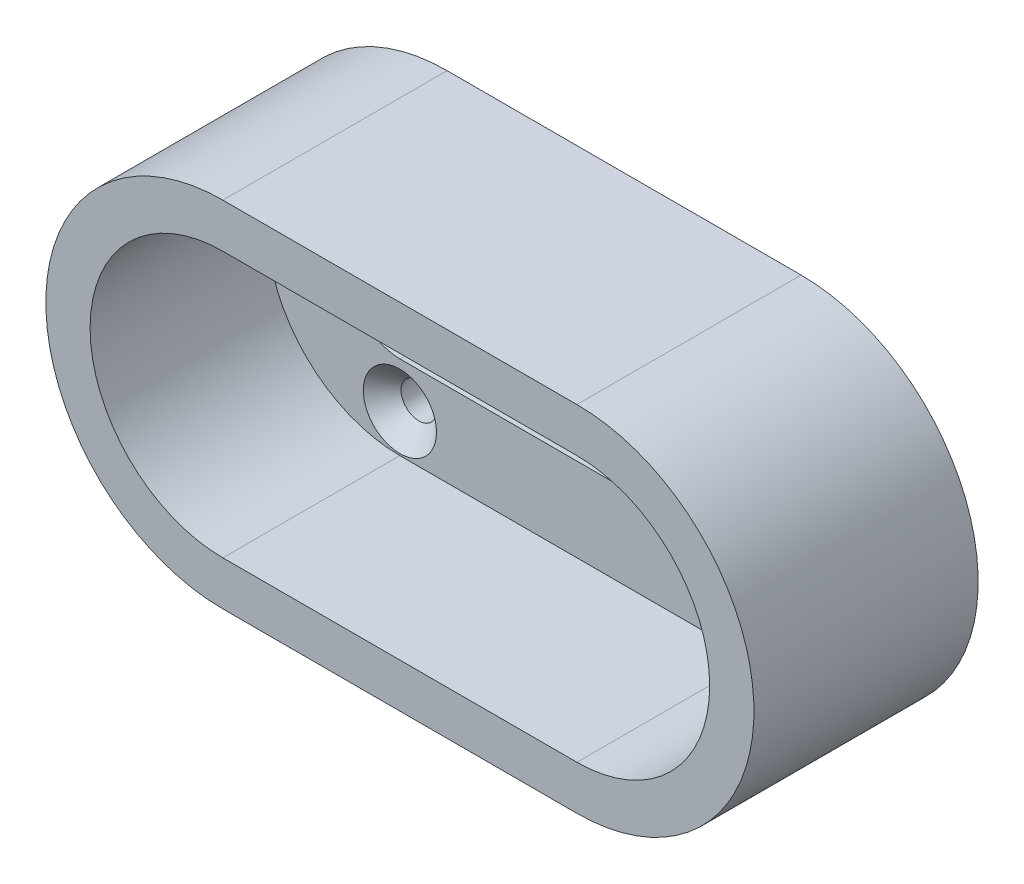
ISO-10303-21;
HEADER;
FILE_DESCRIPTION(('STEP AP214'),'2;1');
FILE_NAME('part.step','',(''),(''),'','','');
FILE_SCHEMA(('AUTOMOTIVE_DESIGN { 1 0 10303 214 1 1 1 1 }'));
ENDSEC;
DATA;
#1=APPLICATION_CONTEXT('core data for automotive mechanical design processes');
#2=APPLICATION_PROTOCOL_DEFINITION('international standard','automotive_design',2000,#1);
#3=PRODUCT_CONTEXT('',#1,'mechanical');
#4=PRODUCT('Part','Part','',(#3));
#5=PRODUCT_RELATED_PRODUCT_CATEGORY('part','',(#4));
#6=PRODUCT_DEFINITION_FORMATION('','',#4);
#7=PRODUCT_DEFINITION_CONTEXT('part definition',#1,'design');
#8=PRODUCT_DEFINITION('design','',#6,#7);
#9=PRODUCT_DEFINITION_SHAPE('','',#8);
#10=(LENGTH_UNIT() NAMED_UNIT(*) SI_UNIT(.MILLI.,.METRE.));
#11=(NAMED_UNIT(*) PLANE_ANGLE_UNIT() SI_UNIT($,.RADIAN.));
#12=(NAMED_UNIT(*) SI_UNIT($,.STERADIAN.) SOLID_ANGLE_UNIT());
#13=UNCERTAINTY_MEASURE_WITH_UNIT(LENGTH_MEASURE(1.E-05),#10,'distance_accuracy_value','');
#14=(GEOMETRIC_REPRESENTATION_CONTEXT(3) GLOBAL_UNCERTAINTY_ASSIGNED_CONTEXT((#13)) GLOBAL_UNIT_ASSIGNED_CONTEXT((#10,
#11,#12)) REPRESENTATION_CONTEXT('',''));
#15=CARTESIAN_POINT('',(0.,0.,0.));
#16=DIRECTION('',(0.,0.,1.));
#17=DIRECTION('',(1.,0.,0.));
#18=AXIS2_PLACEMENT_3D('',#15,#16,#17);
#19=CARTESIAN_POINT('',(-15.,0.,4.));
#20=DIRECTION('',(0.,0.,1.));
#21=DIRECTION('',(1.,0.,0.));
#22=AXIS2_PLACEMENT_3D('',#19,#20,#21);
#23=PLANE('',#22);
#24=CARTESIAN_POINT('',(15.,-8.,4.));
#25=DIRECTION('',(0.,0.,1.));
#26=DIRECTION('',(1.,0.,0.));
#27=AXIS2_PLACEMENT_3D('',#24,#25,#26);
#28=CIRCLE('',#27,3.10000000000001);
#29=CARTESIAN_POINT('',(18.1,-8.,4.));
#30=VERTEX_POINT('',#29);
#31=EDGE_CURVE('E318',#30,#30,#28,.F.);
#32=ORIENTED_EDGE('',*,*,#31,.T.);
#33=EDGE_LOOP('',(#32));
#34=FACE_BOUND('',#33,.T.);
#35=CARTESIAN_POINT('',(23.,0.,4.));
#36=DIRECTION('',(0.,0.,1.));
#37=DIRECTION('',(1.,0.,0.));
#38=AXIS2_PLACEMENT_3D('',#35,#36,#37);
#39=CIRCLE('',#38,3.10000000000001);
#40=CARTESIAN_POINT('',(26.1,0.,4.));
#41=VERTEX_POINT('',#40);
#42=EDGE_CURVE('E314',#41,#41,#39,.F.);
#43=ORIENTED_EDGE('',*,*,#42,.T.);
#44=EDGE_LOOP('',(#43));
#45=FACE_BOUND('',#44,.T.);
#46=CARTESIAN_POINT('',(15.,8.,4.));
#47=DIRECTION('',(0.,0.,1.));
#48=DIRECTION('',(1.,0.,0.));
#49=AXIS2_PLACEMENT_3D('',#46,#47,#48);
#50=CIRCLE('',#49,3.10000000000001);
#51=CARTESIAN_POINT('',(18.1,8.,4.));
#52=VERTEX_POINT('',#51);
#53=EDGE_CURVE('E310',#52,#52,#50,.F.);
#54=ORIENTED_EDGE('',*,*,#53,.T.);
#55=EDGE_LOOP('',(#54));
#56=FACE_BOUND('',#55,.T.);
#57=CARTESIAN_POINT('',(-15.,-8.,4.));
#58=DIRECTION('',(0.,0.,1.));
#59=DIRECTION('',(1.,0.,0.));
#60=AXIS2_PLACEMENT_3D('',#57,#58,#59);
#61=CIRCLE('',#60,3.10000000000001);
#62=CARTESIAN_POINT('',(-11.9,-8.,4.));
#63=VERTEX_POINT('',#62);
#64=EDGE_CURVE('E306',#63,#63,#61,.F.);
#65=ORIENTED_EDGE('',*,*,#64,.T.);
#66=EDGE_LOOP('',(#65));
#67=FACE_BOUND('',#66,.T.);
#68=CARTESIAN_POINT('',(-23.,0.,4.));
#69=DIRECTION('',(0.,0.,1.));
#70=DIRECTION('',(1.,0.,0.));
#71=AXIS2_PLACEMENT_3D('',#68,#69,#70);
#72=CIRCLE('',#71,3.10000000000001);
#73=CARTESIAN_POINT('',(-19.9,0.,4.));
#74=VERTEX_POINT('',#73);
#75=EDGE_CURVE('E302',#74,#74,#72,.F.);
#76=ORIENTED_EDGE('',*,*,#75,.T.);
#77=EDGE_LOOP('',(#76));
#78=FACE_BOUND('',#77,.T.);
#79=CARTESIAN_POINT('',(-15.,8.,4.));
#80=DIRECTION('',(0.,0.,1.));
#81=DIRECTION('',(1.,0.,0.));
#82=AXIS2_PLACEMENT_3D('',#79,#80,#81);
#83=CIRCLE('',#82,3.10000000000001);
#84=CARTESIAN_POINT('',(-11.9,8.,4.));
#85=VERTEX_POINT('',#84);
#86=EDGE_CURVE('E298',#85,#85,#83,.F.);
#87=ORIENTED_EDGE('',*,*,#86,.T.);
#88=EDGE_LOOP('',(#87));
#89=FACE_BOUND('',#88,.T.);
#90=DIRECTION('',(1.,0.,0.));
#91=VECTOR('',#90,1.);
#92=CARTESIAN_POINT('',(-15.,-4.15,4.));
#93=LINE('',#92,#91);
#94=CARTESIAN_POINT('',(-15.,-4.15,4.));
#95=VERTEX_POINT('',#94);
#96=CARTESIAN_POINT('',(15.,-4.15,4.));
#97=VERTEX_POINT('',#96);
#98=EDGE_CURVE('E204',#95,#97,#93,.T.);
#99=ORIENTED_EDGE('',*,*,#98,.F.);
#100=CARTESIAN_POINT('',(-15.,0.,4.));
#101=DIRECTION('',(0.,0.,1.));
#102=DIRECTION('',(1.,0.,0.));
#103=AXIS2_PLACEMENT_3D('',#100,#101,#102);
#104=CIRCLE('',#103,4.15);
#105=CARTESIAN_POINT('',(-15.,4.15,4.));
#106=VERTEX_POINT('',#105);
#107=EDGE_CURVE('E201',#106,#95,#104,.T.);
#108=ORIENTED_EDGE('',*,*,#107,.F.);
#109=DIRECTION('',(-1.,0.,0.));
#110=VECTOR('',#109,1.);
#111=CARTESIAN_POINT('',(-15.,4.15,4.));
#112=LINE('',#111,#110);
#113=CARTESIAN_POINT('',(15.,4.15,4.));
#114=VERTEX_POINT('',#113);
#115=EDGE_CURVE('E211',#114,#106,#112,.T.);
#116=ORIENTED_EDGE('',*,*,#115,.F.);
#117=CARTESIAN_POINT('',(15.,0.,4.));
#118=DIRECTION('',(0.,0.,1.));
#119=DIRECTION('',(1.,0.,0.));
#120=AXIS2_PLACEMENT_3D('',#117,#118,#119);
#121=CIRCLE('',#120,4.15);
#122=EDGE_CURVE('E208',#97,#114,#121,.T.);
#123=ORIENTED_EDGE('',*,*,#122,.F.);
#124=EDGE_LOOP('',(#99,#108,#116,#123));
#125=FACE_BOUND('',#124,.T.);
#126=DIRECTION('',(-1.,0.,0.));
#127=VECTOR('',#126,1.);
#128=CARTESIAN_POINT('',(-15.,11.25,4.));
#129=LINE('',#128,#127);
#130=CARTESIAN_POINT('',(15.,11.25,4.));
#131=VERTEX_POINT('',#130);
#132=CARTESIAN_POINT('',(-15.,11.25,4.));
#133=VERTEX_POINT('',#132);
#134=EDGE_CURVE('E143',#131,#133,#129,.T.);
#135=ORIENTED_EDGE('',*,*,#134,.T.);
#136=CARTESIAN_POINT('',(-15.,0.,4.));
#137=DIRECTION('',(0.,0.,1.));
#138=DIRECTION('',(1.,0.,0.));
#139=AXIS2_PLACEMENT_3D('',#136,#137,#138);
#140=CIRCLE('',#139,11.25);
#141=CARTESIAN_POINT('',(-15.,-11.25,4.));
#142=VERTEX_POINT('',#141);
#143=EDGE_CURVE('E166',#133,#142,#140,.T.);
#144=ORIENTED_EDGE('',*,*,#143,.T.);
#145=DIRECTION('',(1.,0.,0.));
#146=VECTOR('',#145,1.);
#147=CARTESIAN_POINT('',(-15.,-11.25,4.));
#148=LINE('',#147,#146);
#149=CARTESIAN_POINT('',(15.,-11.25,4.));
#150=VERTEX_POINT('',#149);
#151=EDGE_CURVE('E149',#142,#150,#148,.T.);
#152=ORIENTED_EDGE('',*,*,#151,.T.);
#153=CARTESIAN_POINT('',(15.,0.,4.));
#154=DIRECTION('',(0.,0.,1.));
#155=DIRECTION('',(1.,0.,0.));
#156=AXIS2_PLACEMENT_3D('',#153,#154,#155);
#157=CIRCLE('',#156,11.25);
#158=EDGE_CURVE('E171',#150,#131,#157,.T.);
#159=ORIENTED_EDGE('',*,*,#158,.T.);
#160=EDGE_LOOP('',(#135,#144,#152,#159));
#161=FACE_BOUND('',#160,.T.);
#162=ADVANCED_FACE('F41',(#34,#45,#56,#67,#78,#89,#125,#161),#23,.T.);
#163=CARTESIAN_POINT('',(-15.,0.,0.));
#164=DIRECTION('',(0.,0.,1.));
#165=DIRECTION('',(1.,0.,0.));
#166=AXIS2_PLACEMENT_3D('',#163,#164,#165);
#167=PLANE('',#166);
#168=CARTESIAN_POINT('',(15.,8.,0.));
#169=DIRECTION('',(0.,0.,1.));
#170=DIRECTION('',(-1.,0.,0.));
#171=AXIS2_PLACEMENT_3D('',#168,#169,#170);
#172=CIRCLE('',#171,1.5);
#173=CARTESIAN_POINT('',(13.5,8.,0.));
#174=VERTEX_POINT('',#173);
#175=EDGE_CURVE('E241',#174,#174,#172,.T.);
#176=ORIENTED_EDGE('',*,*,#175,.T.);
#177=EDGE_LOOP('',(#176));
#178=FACE_BOUND('',#177,.T.);
#179=CARTESIAN_POINT('',(23.,0.,0.));
#180=DIRECTION('',(0.,0.,1.));
#181=DIRECTION('',(-1.,0.,0.));
#182=AXIS2_PLACEMENT_3D('',#179,#180,#181);
#183=CIRCLE('',#182,1.5);
#184=CARTESIAN_POINT('',(21.5,0.,0.));
#185=VERTEX_POINT('',#184);
#186=EDGE_CURVE('E245',#185,#185,#183,.T.);
#187=ORIENTED_EDGE('',*,*,#186,.T.);
#188=EDGE_LOOP('',(#187));
#189=FACE_BOUND('',#188,.T.);
#190=CARTESIAN_POINT('',(15.,-8.,0.));
#191=DIRECTION('',(0.,0.,1.));
#192=DIRECTION('',(-1.,0.,0.));
#193=AXIS2_PLACEMENT_3D('',#190,#191,#192);
#194=CIRCLE('',#193,1.5);
#195=CARTESIAN_POINT('',(13.5,-8.,0.));
#196=VERTEX_POINT('',#195);
#197=EDGE_CURVE('E249',#196,#196,#194,.T.);
#198=ORIENTED_EDGE('',*,*,#197,.T.);
#199=EDGE_LOOP('',(#198));
#200=FACE_BOUND('',#199,.T.);
#201=CARTESIAN_POINT('',(-15.,-8.,0.));
#202=DIRECTION('',(0.,0.,1.));
#203=DIRECTION('',(1.,0.,0.));
#204=AXIS2_PLACEMENT_3D('',#201,#202,#203);
#205=CIRCLE('',#204,1.5);
#206=CARTESIAN_POINT('',(-13.5,-8.,0.));
#207=VERTEX_POINT('',#206);
#208=EDGE_CURVE('E253',#207,#207,#205,.T.);
#209=ORIENTED_EDGE('',*,*,#208,.T.);
#210=EDGE_LOOP('',(#209));
#211=FACE_BOUND('',#210,.T.);
#212=CARTESIAN_POINT('',(-23.,0.,0.));
#213=DIRECTION('',(0.,0.,1.));
#214=DIRECTION('',(1.,0.,0.));
#215=AXIS2_PLACEMENT_3D('',#212,#213,#214);
#216=CIRCLE('',#215,1.5);
#217=CARTESIAN_POINT('',(-21.5,0.,0.));
#218=VERTEX_POINT('',#217);
#219=EDGE_CURVE('E257',#218,#218,#216,.T.);
#220=ORIENTED_EDGE('',*,*,#219,.T.);
#221=EDGE_LOOP('',(#220));
#222=FACE_BOUND('',#221,.T.);
#223=CARTESIAN_POINT('',(-15.,8.,0.));
#224=DIRECTION('',(0.,0.,1.));
#225=DIRECTION('',(1.,0.,0.));
#226=AXIS2_PLACEMENT_3D('',#223,#224,#225);
#227=CIRCLE('',#226,1.5);
#228=CARTESIAN_POINT('',(-13.5,8.,0.));
#229=VERTEX_POINT('',#228);
#230=EDGE_CURVE('E261',#229,#229,#227,.T.);
#231=ORIENTED_EDGE('',*,*,#230,.T.);
#232=EDGE_LOOP('',(#231));
#233=FACE_BOUND('',#232,.T.);
#234=CARTESIAN_POINT('',(-15.,0.,0.));
#235=DIRECTION('',(0.,0.,1.));
#236=DIRECTION('',(1.,0.,0.));
#237=AXIS2_PLACEMENT_3D('',#234,#235,#236);
#238=CIRCLE('',#237,15.);
#239=CARTESIAN_POINT('',(-15.,15.,0.));
#240=VERTEX_POINT('',#239);
#241=CARTESIAN_POINT('',(-15.,-15.,0.));
#242=VERTEX_POINT('',#241);
#243=EDGE_CURVE('E265',#240,#242,#238,.T.);
#244=ORIENTED_EDGE('',*,*,#243,.F.);
#245=DIRECTION('',(-1.,0.,0.));
#246=VECTOR('',#245,1.);
#247=CARTESIAN_POINT('',(-15.,15.,0.));
#248=LINE('',#247,#246);
#249=CARTESIAN_POINT('',(15.,15.,0.));
#250=VERTEX_POINT('',#249);
#251=EDGE_CURVE('E275',#250,#240,#248,.T.);
#252=ORIENTED_EDGE('',*,*,#251,.F.);
#253=CARTESIAN_POINT('',(15.,0.,0.));
#254=DIRECTION('',(0.,0.,1.));
#255=DIRECTION('',(1.,0.,0.));
#256=AXIS2_PLACEMENT_3D('',#253,#254,#255);
#257=CIRCLE('',#256,15.);
#258=CARTESIAN_POINT('',(15.,-15.,0.));
#259=VERTEX_POINT('',#258);
#260=EDGE_CURVE('E272',#259,#250,#257,.T.);
#261=ORIENTED_EDGE('',*,*,#260,.F.);
#262=DIRECTION('',(1.,0.,0.));
#263=VECTOR('',#262,1.);
#264=CARTESIAN_POINT('',(-15.,-15.,0.));
#265=LINE('',#264,#263);
#266=EDGE_CURVE('E269',#242,#259,#265,.T.);
#267=ORIENTED_EDGE('',*,*,#266,.F.);
#268=EDGE_LOOP('',(#244,#252,#261,#267));
#269=FACE_BOUND('',#268,.T.);
#270=CARTESIAN_POINT('',(-15.,0.,0.));
#271=DIRECTION('',(0.,0.,1.));
#272=DIRECTION('',(1.,0.,0.));
#273=AXIS2_PLACEMENT_3D('',#270,#271,#272);
#274=CIRCLE('',#273,4.15);
#275=CARTESIAN_POINT('',(-15.,4.15,0.));
#276=VERTEX_POINT('',#275);
#277=CARTESIAN_POINT('',(-15.,-4.15,0.));
#278=VERTEX_POINT('',#277);
#279=EDGE_CURVE('E200',#276,#278,#274,.T.);
#280=ORIENTED_EDGE('',*,*,#279,.T.);
#281=DIRECTION('',(1.,0.,0.));
#282=VECTOR('',#281,1.);
#283=CARTESIAN_POINT('',(-15.,-4.15,0.));
#284=LINE('',#283,#282);
#285=CARTESIAN_POINT('',(15.,-4.15,0.));
#286=VERTEX_POINT('',#285);
#287=EDGE_CURVE('E218',#278,#286,#284,.T.);
#288=ORIENTED_EDGE('',*,*,#287,.T.);
#289=CARTESIAN_POINT('',(15.,0.,0.));
#290=DIRECTION('',(0.,0.,1.));
#291=DIRECTION('',(1.,0.,0.));
#292=AXIS2_PLACEMENT_3D('',#289,#290,#291);
#293=CIRCLE('',#292,4.15);
#294=CARTESIAN_POINT('',(15.,4.15,0.));
#295=VERTEX_POINT('',#294);
#296=EDGE_CURVE('E222',#286,#295,#293,.T.);
#297=ORIENTED_EDGE('',*,*,#296,.T.);
#298=DIRECTION('',(-1.,0.,0.));
#299=VECTOR('',#298,1.);
#300=CARTESIAN_POINT('',(-15.,4.15,0.));
#301=LINE('',#300,#299);
#302=EDGE_CURVE('E205',#295,#276,#301,.T.);
#303=ORIENTED_EDGE('',*,*,#302,.T.);
#304=EDGE_LOOP('',(#280,#288,#297,#303));
#305=FACE_BOUND('',#304,.T.);
#306=ADVANCED_FACE('F355',(#178,#189,#200,#211,#222,#233,#269,#305),#167,.F.);
#307=CARTESIAN_POINT('',(-15.,0.,4.));
#308=DIRECTION('',(0.,0.,-1.));
#309=DIRECTION('',(-1.,0.,0.));
#310=AXIS2_PLACEMENT_3D('',#307,#308,#309);
#311=CYLINDRICAL_SURFACE('',#310,15.);
#312=ORIENTED_EDGE('',*,*,#243,.T.);
#313=DIRECTION('',(0.,0.,-1.));
#314=VECTOR('',#313,1.);
#315=CARTESIAN_POINT('',(-15.,-15.,4.));
#316=LINE('',#315,#314);
#317=CARTESIAN_POINT('',(-15.,-15.,19.));
#318=VERTEX_POINT('',#317);
#319=EDGE_CURVE('E290',#318,#242,#316,.T.);
#320=ORIENTED_EDGE('',*,*,#319,.F.);
#321=CARTESIAN_POINT('',(-15.,0.,19.));
#322=DIRECTION('',(0.,0.,1.));
#323=DIRECTION('',(1.,0.,0.));
#324=AXIS2_PLACEMENT_3D('',#321,#322,#323);
#325=CIRCLE('',#324,15.);
#326=CARTESIAN_POINT('',(-15.,15.,19.));
#327=VERTEX_POINT('',#326);
#328=EDGE_CURVE('E151',#327,#318,#325,.T.);
#329=ORIENTED_EDGE('',*,*,#328,.F.);
#330=DIRECTION('',(0.,0.,-1.));
#331=VECTOR('',#330,1.);
#332=CARTESIAN_POINT('',(-15.,15.,4.));
#333=LINE('',#332,#331);
#334=EDGE_CURVE('E278',#327,#240,#333,.T.);
#335=ORIENTED_EDGE('',*,*,#334,.T.);
#336=EDGE_LOOP('',(#312,#320,#329,#335));
#337=FACE_BOUND('',#336,.T.);
#338=ADVANCED_FACE('F361',(#337),#311,.T.);
#339=CARTESIAN_POINT('',(-15.,-15.,4.));
#340=DIRECTION('',(0.,1.,0.));
#341=DIRECTION('',(-1.,0.,0.));
#342=AXIS2_PLACEMENT_3D('',#339,#340,#341);
#343=PLANE('',#342);
#344=ORIENTED_EDGE('',*,*,#266,.T.);
#345=DIRECTION('',(0.,0.,-1.));
#346=VECTOR('',#345,1.);
#347=CARTESIAN_POINT('',(15.,-15.,4.));
#348=LINE('',#347,#346);
#349=CARTESIAN_POINT('',(15.,-15.,19.));
#350=VERTEX_POINT('',#349);
#351=EDGE_CURVE('E286',#350,#259,#348,.T.);
#352=ORIENTED_EDGE('',*,*,#351,.F.);
#353=DIRECTION('',(1.,0.,0.));
#354=VECTOR('',#353,1.);
#355=CARTESIAN_POINT('',(-15.,-15.,19.));
#356=LINE('',#355,#354);
#357=EDGE_CURVE('E188',#318,#350,#356,.T.);
#358=ORIENTED_EDGE('',*,*,#357,.F.);
#359=ORIENTED_EDGE('',*,*,#319,.T.);
#360=EDGE_LOOP('',(#344,#352,#358,#359));
#361=FACE_BOUND('',#360,.T.);
#362=ADVANCED_FACE('F376',(#361),#343,.F.);
#363=CARTESIAN_POINT('',(15.,0.,4.));
#364=DIRECTION('',(0.,0.,-1.));
#365=DIRECTION('',(-1.,0.,0.));
#366=AXIS2_PLACEMENT_3D('',#363,#364,#365);
#367=CYLINDRICAL_SURFACE('',#366,15.);
#368=ORIENTED_EDGE('',*,*,#260,.T.);
#369=DIRECTION('',(0.,0.,-1.));
#370=VECTOR('',#369,1.);
#371=CARTESIAN_POINT('',(15.,15.,4.));
#372=LINE('',#371,#370);
#373=CARTESIAN_POINT('',(15.,15.,19.));
#374=VERTEX_POINT('',#373);
#375=EDGE_CURVE('E282',#374,#250,#372,.T.);
#376=ORIENTED_EDGE('',*,*,#375,.F.);
#377=CARTESIAN_POINT('',(15.,0.,19.));
#378=DIRECTION('',(0.,0.,1.));
#379=DIRECTION('',(1.,0.,0.));
#380=AXIS2_PLACEMENT_3D('',#377,#378,#379);
#381=CIRCLE('',#380,15.);
#382=EDGE_CURVE('E192',#350,#374,#381,.T.);
#383=ORIENTED_EDGE('',*,*,#382,.F.);
#384=ORIENTED_EDGE('',*,*,#351,.T.);
#385=EDGE_LOOP('',(#368,#376,#383,#384));
#386=FACE_BOUND('',#385,.T.);
#387=ADVANCED_FACE('F372',(#386),#367,.T.);
#388=CARTESIAN_POINT('',(-15.,15.,4.));
#389=DIRECTION('',(0.,-1.,0.));
#390=DIRECTION('',(1.,0.,0.));
#391=AXIS2_PLACEMENT_3D('',#388,#389,#390);
#392=PLANE('',#391);
#393=ORIENTED_EDGE('',*,*,#251,.T.);
#394=ORIENTED_EDGE('',*,*,#334,.F.);
#395=DIRECTION('',(-1.,0.,0.));
#396=VECTOR('',#395,1.);
#397=CARTESIAN_POINT('',(15.,15.,19.));
#398=LINE('',#397,#396);
#399=EDGE_CURVE('E196',#374,#327,#398,.T.);
#400=ORIENTED_EDGE('',*,*,#399,.F.);
#401=ORIENTED_EDGE('',*,*,#375,.T.);
#402=EDGE_LOOP('',(#393,#394,#400,#401));
#403=FACE_BOUND('',#402,.T.);
#404=ADVANCED_FACE('F369',(#403),#392,.F.);
#405=CARTESIAN_POINT('',(-15.,8.,4.));
#406=DIRECTION('',(0.,0.,-1.));
#407=DIRECTION('',(-1.,0.,0.));
#408=AXIS2_PLACEMENT_3D('',#405,#406,#407);
#409=CYLINDRICAL_SURFACE('',#408,1.5);
#410=CARTESIAN_POINT('',(-15.,8.,2.4));
#411=DIRECTION('',(0.,0.,1.));
#412=DIRECTION('',(1.,0.,0.));
#413=AXIS2_PLACEMENT_3D('',#410,#411,#412);
#414=CIRCLE('',#413,1.5);
#415=CARTESIAN_POINT('',(-13.5,8.,2.4));
#416=VERTEX_POINT('',#415);
#417=EDGE_CURVE('E11',#416,#416,#414,.T.);
#418=ORIENTED_EDGE('',*,*,#417,.T.);
#419=EDGE_LOOP('',(#418));
#420=FACE_BOUND('',#419,.T.);
#421=ORIENTED_EDGE('',*,*,#230,.F.);
#422=EDGE_LOOP('',(#421));
#423=FACE_BOUND('',#422,.T.);
#424=ADVANCED_FACE('F366',(#420,#423),#409,.F.);
#425=CARTESIAN_POINT('',(-23.,0.,4.));
#426=DIRECTION('',(0.,0.,-1.));
#427=DIRECTION('',(-1.,0.,0.));
#428=AXIS2_PLACEMENT_3D('',#425,#426,#427);
#429=CYLINDRICAL_SURFACE('',#428,1.5);
#430=CARTESIAN_POINT('',(-23.,0.,2.4));
#431=DIRECTION('',(0.,0.,1.));
#432=DIRECTION('',(1.,0.,0.));
#433=AXIS2_PLACEMENT_3D('',#430,#431,#432);
#434=CIRCLE('',#433,1.5);
#435=CARTESIAN_POINT('',(-21.5,0.,2.4));
#436=VERTEX_POINT('',#435);
#437=EDGE_CURVE('E51',#436,#436,#434,.T.);
#438=ORIENTED_EDGE('',*,*,#437,.T.);
#439=EDGE_LOOP('',(#438));
#440=FACE_BOUND('',#439,.T.);
#441=ORIENTED_EDGE('',*,*,#219,.F.);
#442=EDGE_LOOP('',(#441));
#443=FACE_BOUND('',#442,.T.);
#444=ADVANCED_FACE('F337',(#440,#443),#429,.F.);
#445=CARTESIAN_POINT('',(-15.,-8.,4.));
#446=DIRECTION('',(0.,0.,-1.));
#447=DIRECTION('',(-1.,0.,0.));
#448=AXIS2_PLACEMENT_3D('',#445,#446,#447);
#449=CYLINDRICAL_SURFACE('',#448,1.5);
#450=CARTESIAN_POINT('',(-15.,-8.,2.4));
#451=DIRECTION('',(0.,0.,1.));
#452=DIRECTION('',(1.,0.,0.));
#453=AXIS2_PLACEMENT_3D('',#450,#451,#452);
#454=CIRCLE('',#453,1.5);
#455=CARTESIAN_POINT('',(-13.5,-8.,2.4));
#456=VERTEX_POINT('',#455);
#457=EDGE_CURVE('E330',#456,#456,#454,.T.);
#458=ORIENTED_EDGE('',*,*,#457,.T.);
#459=EDGE_LOOP('',(#458));
#460=FACE_BOUND('',#459,.T.);
#461=ORIENTED_EDGE('',*,*,#208,.F.);
#462=EDGE_LOOP('',(#461));
#463=FACE_BOUND('',#462,.T.);
#464=ADVANCED_FACE('F472',(#460,#463),#449,.F.);
#465=CARTESIAN_POINT('',(15.,-8.,4.));
#466=DIRECTION('',(0.,0.,-1.));
#467=DIRECTION('',(-1.,0.,0.));
#468=AXIS2_PLACEMENT_3D('',#465,#466,#467);
#469=CYLINDRICAL_SURFACE('',#468,1.5);
#470=CARTESIAN_POINT('',(15.,-8.,2.4));
#471=DIRECTION('',(0.,0.,1.));
#472=DIRECTION('',(1.,0.,0.));
#473=AXIS2_PLACEMENT_3D('',#470,#471,#472);
#474=CIRCLE('',#473,1.5);
#475=CARTESIAN_POINT('',(16.5,-8.,2.4));
#476=VERTEX_POINT('',#475);
#477=EDGE_CURVE('E294',#476,#476,#474,.T.);
#478=ORIENTED_EDGE('',*,*,#477,.T.);
#479=EDGE_LOOP('',(#478));
#480=FACE_BOUND('',#479,.T.);
#481=ORIENTED_EDGE('',*,*,#197,.F.);
#482=EDGE_LOOP('',(#481));
#483=FACE_BOUND('',#482,.T.);
#484=ADVANCED_FACE('F468',(#480,#483),#469,.F.);
#485=CARTESIAN_POINT('',(23.,0.,4.));
#486=DIRECTION('',(0.,0.,-1.));
#487=DIRECTION('',(-1.,0.,0.));
#488=AXIS2_PLACEMENT_3D('',#485,#486,#487);
#489=CYLINDRICAL_SURFACE('',#488,1.5);
#490=CARTESIAN_POINT('',(23.,0.,2.4));
#491=DIRECTION('',(0.,0.,1.));
#492=DIRECTION('',(1.,0.,0.));
#493=AXIS2_PLACEMENT_3D('',#490,#491,#492);
#494=CIRCLE('',#493,1.5);
#495=CARTESIAN_POINT('',(24.5,0.,2.4));
#496=VERTEX_POINT('',#495);
#497=EDGE_CURVE('E322',#496,#496,#494,.T.);
#498=ORIENTED_EDGE('',*,*,#497,.T.);
#499=EDGE_LOOP('',(#498));
#500=FACE_BOUND('',#499,.T.);
#501=ORIENTED_EDGE('',*,*,#186,.F.);
#502=EDGE_LOOP('',(#501));
#503=FACE_BOUND('',#502,.T.);
#504=ADVANCED_FACE('F421',(#500,#503),#489,.F.);
#505=CARTESIAN_POINT('',(15.,8.,4.));
#506=DIRECTION('',(0.,0.,-1.));
#507=DIRECTION('',(-1.,0.,0.));
#508=AXIS2_PLACEMENT_3D('',#505,#506,#507);
#509=CYLINDRICAL_SURFACE('',#508,1.5);
#510=CARTESIAN_POINT('',(15.,8.,2.39999999999999));
#511=DIRECTION('',(0.,0.,1.));
#512=DIRECTION('',(1.,0.,0.));
#513=AXIS2_PLACEMENT_3D('',#510,#511,#512);
#514=CIRCLE('',#513,1.5);
#515=CARTESIAN_POINT('',(16.5,8.,2.39999999999999));
#516=VERTEX_POINT('',#515);
#517=EDGE_CURVE('E326',#516,#516,#514,.T.);
#518=ORIENTED_EDGE('',*,*,#517,.T.);
#519=EDGE_LOOP('',(#518));
#520=FACE_BOUND('',#519,.T.);
#521=ORIENTED_EDGE('',*,*,#175,.F.);
#522=EDGE_LOOP('',(#521));
#523=FACE_BOUND('',#522,.T.);
#524=ADVANCED_FACE('F417',(#520,#523),#509,.F.);
#525=CARTESIAN_POINT('',(-15.,0.,4.));
#526=DIRECTION('',(0.,0.,-1.));
#527=DIRECTION('',(-1.,0.,0.));
#528=AXIS2_PLACEMENT_3D('',#525,#526,#527);
#529=CYLINDRICAL_SURFACE('',#528,4.15);
#530=ORIENTED_EDGE('',*,*,#279,.F.);
#531=DIRECTION('',(0.,0.,-1.));
#532=VECTOR('',#531,1.);
#533=CARTESIAN_POINT('',(-15.,4.15,4.));
#534=LINE('',#533,#532);
#535=EDGE_CURVE('E214',#106,#276,#534,.T.);
#536=ORIENTED_EDGE('',*,*,#535,.F.);
#537=ORIENTED_EDGE('',*,*,#107,.T.);
#538=DIRECTION('',(0.,0.,-1.));
#539=VECTOR('',#538,1.);
#540=CARTESIAN_POINT('',(-15.,-4.15,4.));
#541=LINE('',#540,#539);
#542=EDGE_CURVE('E237',#95,#278,#541,.T.);
#543=ORIENTED_EDGE('',*,*,#542,.T.);
#544=EDGE_LOOP('',(#530,#536,#537,#543));
#545=FACE_BOUND('',#544,.T.);
#546=ADVANCED_FACE('F420',(#545),#529,.F.);
#547=CARTESIAN_POINT('',(-15.,-4.15,4.));
#548=DIRECTION('',(0.,1.,0.));
#549=DIRECTION('',(0.,0.,1.));
#550=AXIS2_PLACEMENT_3D('',#547,#548,#549);
#551=PLANE('',#550);
#552=ORIENTED_EDGE('',*,*,#287,.F.);
#553=ORIENTED_EDGE('',*,*,#542,.F.);
#554=ORIENTED_EDGE('',*,*,#98,.T.);
#555=DIRECTION('',(0.,0.,-1.));
#556=VECTOR('',#555,1.);
#557=CARTESIAN_POINT('',(15.,-4.15,4.));
#558=LINE('',#557,#556);
#559=EDGE_CURVE('E234',#97,#286,#558,.T.);
#560=ORIENTED_EDGE('',*,*,#559,.T.);
#561=EDGE_LOOP('',(#552,#553,#554,#560));
#562=FACE_BOUND('',#561,.T.);
#563=ADVANCED_FACE('F449',(#562),#551,.T.);
#564=CARTESIAN_POINT('',(15.,0.,4.));
#565=DIRECTION('',(0.,0.,-1.));
#566=DIRECTION('',(-1.,0.,0.));
#567=AXIS2_PLACEMENT_3D('',#564,#565,#566);
#568=CYLINDRICAL_SURFACE('',#567,4.15);
#569=ORIENTED_EDGE('',*,*,#296,.F.);
#570=ORIENTED_EDGE('',*,*,#559,.F.);
#571=ORIENTED_EDGE('',*,*,#122,.T.);
#572=DIRECTION('',(0.,0.,-1.));
#573=VECTOR('',#572,1.);
#574=CARTESIAN_POINT('',(15.,4.15,4.));
#575=LINE('',#574,#573);
#576=EDGE_CURVE('E66',#114,#295,#575,.T.);
#577=ORIENTED_EDGE('',*,*,#576,.T.);
#578=EDGE_LOOP('',(#569,#570,#571,#577));
#579=FACE_BOUND('',#578,.T.);
#580=ADVANCED_FACE('F453',(#579),#568,.F.);
#581=CARTESIAN_POINT('',(-15.,4.15,4.));
#582=DIRECTION('',(0.,-1.,0.));
#583=DIRECTION('',(0.,0.,-1.));
#584=AXIS2_PLACEMENT_3D('',#581,#582,#583);
#585=PLANE('',#584);
#586=ORIENTED_EDGE('',*,*,#302,.F.);
#587=ORIENTED_EDGE('',*,*,#576,.F.);
#588=ORIENTED_EDGE('',*,*,#115,.T.);
#589=ORIENTED_EDGE('',*,*,#535,.T.);
#590=EDGE_LOOP('',(#586,#587,#588,#589));
#591=FACE_BOUND('',#590,.T.);
#592=ADVANCED_FACE('F442',(#591),#585,.T.);
#593=CARTESIAN_POINT('',(-15.,0.,19.));
#594=DIRECTION('',(0.,0.,1.));
#595=DIRECTION('',(1.,0.,0.));
#596=AXIS2_PLACEMENT_3D('',#593,#594,#595);
#597=PLANE('',#596);
#598=ORIENTED_EDGE('',*,*,#328,.T.);
#599=ORIENTED_EDGE('',*,*,#357,.T.);
#600=ORIENTED_EDGE('',*,*,#382,.T.);
#601=ORIENTED_EDGE('',*,*,#399,.T.);
#602=EDGE_LOOP('',(#598,#599,#600,#601));
#603=FACE_BOUND('',#602,.T.);
#604=DIRECTION('',(1.,0.,0.));
#605=VECTOR('',#604,1.);
#606=CARTESIAN_POINT('',(-15.,-11.25,19.));
#607=LINE('',#606,#605);
#608=CARTESIAN_POINT('',(-15.,-11.25,19.));
#609=VERTEX_POINT('',#608);
#610=CARTESIAN_POINT('',(15.,-11.25,19.));
#611=VERTEX_POINT('',#610);
#612=EDGE_CURVE('E142',#609,#611,#607,.T.);
#613=ORIENTED_EDGE('',*,*,#612,.F.);
#614=CARTESIAN_POINT('',(-15.,0.,19.));
#615=DIRECTION('',(0.,0.,1.));
#616=DIRECTION('',(1.,0.,0.));
#617=AXIS2_PLACEMENT_3D('',#614,#615,#616);
#618=CIRCLE('',#617,11.25);
#619=CARTESIAN_POINT('',(-15.,11.25,19.));
#620=VERTEX_POINT('',#619);
#621=EDGE_CURVE('E133',#620,#609,#618,.T.);
#622=ORIENTED_EDGE('',*,*,#621,.F.);
#623=DIRECTION('',(-1.,0.,0.));
#624=VECTOR('',#623,1.);
#625=CARTESIAN_POINT('',(-15.,11.25,19.));
#626=LINE('',#625,#624);
#627=CARTESIAN_POINT('',(15.,11.25,19.));
#628=VERTEX_POINT('',#627);
#629=EDGE_CURVE('E161',#628,#620,#626,.T.);
#630=ORIENTED_EDGE('',*,*,#629,.F.);
#631=CARTESIAN_POINT('',(15.,0.,19.));
#632=DIRECTION('',(0.,0.,1.));
#633=DIRECTION('',(1.,0.,0.));
#634=AXIS2_PLACEMENT_3D('',#631,#632,#633);
#635=CIRCLE('',#634,11.25);
#636=EDGE_CURVE('E157',#611,#628,#635,.T.);
#637=ORIENTED_EDGE('',*,*,#636,.F.);
#638=EDGE_LOOP('',(#613,#622,#630,#637));
#639=FACE_BOUND('',#638,.T.);
#640=ADVANCED_FACE('F155',(#603,#639),#597,.T.);
#641=CARTESIAN_POINT('',(-15.,0.,19.));
#642=DIRECTION('',(0.,0.,-1.));
#643=DIRECTION('',(-1.,0.,0.));
#644=AXIS2_PLACEMENT_3D('',#641,#642,#643);
#645=CYLINDRICAL_SURFACE('',#644,11.25);
#646=ORIENTED_EDGE('',*,*,#143,.F.);
#647=DIRECTION('',(0.,0.,-1.));
#648=VECTOR('',#647,1.);
#649=CARTESIAN_POINT('',(-15.,11.25,19.));
#650=LINE('',#649,#648);
#651=EDGE_CURVE('E58',#620,#133,#650,.T.);
#652=ORIENTED_EDGE('',*,*,#651,.F.);
#653=ORIENTED_EDGE('',*,*,#621,.T.);
#654=DIRECTION('',(0.,0.,-1.));
#655=VECTOR('',#654,1.);
#656=CARTESIAN_POINT('',(-15.,-11.25,19.));
#657=LINE('',#656,#655);
#658=EDGE_CURVE('E136',#609,#142,#657,.T.);
#659=ORIENTED_EDGE('',*,*,#658,.T.);
#660=EDGE_LOOP('',(#646,#652,#653,#659));
#661=FACE_BOUND('',#660,.T.);
#662=ADVANCED_FACE('F135',(#661),#645,.F.);
#663=CARTESIAN_POINT('',(-15.,-11.25,19.));
#664=DIRECTION('',(0.,1.,0.));
#665=DIRECTION('',(0.,0.,1.));
#666=AXIS2_PLACEMENT_3D('',#663,#664,#665);
#667=PLANE('',#666);
#668=ORIENTED_EDGE('',*,*,#151,.F.);
#669=ORIENTED_EDGE('',*,*,#658,.F.);
#670=ORIENTED_EDGE('',*,*,#612,.T.);
#671=DIRECTION('',(0.,0.,-1.));
#672=VECTOR('',#671,1.);
#673=CARTESIAN_POINT('',(15.,-11.25,19.));
#674=LINE('',#673,#672);
#675=EDGE_CURVE('E152',#611,#150,#674,.T.);
#676=ORIENTED_EDGE('',*,*,#675,.T.);
#677=EDGE_LOOP('',(#668,#669,#670,#676));
#678=FACE_BOUND('',#677,.T.);
#679=ADVANCED_FACE('F146',(#678),#667,.T.);
#680=CARTESIAN_POINT('',(15.,0.,19.));
#681=DIRECTION('',(0.,0.,-1.));
#682=DIRECTION('',(-1.,0.,0.));
#683=AXIS2_PLACEMENT_3D('',#680,#681,#682);
#684=CYLINDRICAL_SURFACE('',#683,11.25);
#685=ORIENTED_EDGE('',*,*,#158,.F.);
#686=ORIENTED_EDGE('',*,*,#675,.F.);
#687=ORIENTED_EDGE('',*,*,#636,.T.);
#688=DIRECTION('',(0.,0.,-1.));
#689=VECTOR('',#688,1.);
#690=CARTESIAN_POINT('',(15.,11.25,19.));
#691=LINE('',#690,#689);
#692=EDGE_CURVE('E180',#628,#131,#691,.T.);
#693=ORIENTED_EDGE('',*,*,#692,.T.);
#694=EDGE_LOOP('',(#685,#686,#687,#693));
#695=FACE_BOUND('',#694,.T.);
#696=ADVANCED_FACE('F551',(#695),#684,.F.);
#697=CARTESIAN_POINT('',(-15.,11.25,19.));
#698=DIRECTION('',(0.,-1.,0.));
#699=DIRECTION('',(0.,0.,-1.));
#700=AXIS2_PLACEMENT_3D('',#697,#698,#699);
#701=PLANE('',#700);
#702=ORIENTED_EDGE('',*,*,#134,.F.);
#703=ORIENTED_EDGE('',*,*,#692,.F.);
#704=ORIENTED_EDGE('',*,*,#629,.T.);
#705=ORIENTED_EDGE('',*,*,#651,.T.);
#706=EDGE_LOOP('',(#702,#703,#704,#705));
#707=FACE_BOUND('',#706,.T.);
#708=ADVANCED_FACE('F392',(#707),#701,.T.);
#709=CARTESIAN_POINT('',(15.,-8.,2.4));
#710=DIRECTION('',(0.,0.,1.));
#711=DIRECTION('',(1.,0.,0.));
#712=AXIS2_PLACEMENT_3D('',#709,#710,#711);
#713=CONICAL_SURFACE('',#712,1.5,0.785398163397452);
#714=ORIENTED_EDGE('',*,*,#31,.F.);
#715=EDGE_LOOP('',(#714));
#716=FACE_BOUND('',#715,.T.);
#717=ORIENTED_EDGE('',*,*,#477,.F.);
#718=EDGE_LOOP('',(#717));
#719=FACE_BOUND('',#718,.T.);
#720=ADVANCED_FACE('F385',(#716,#719),#713,.F.);
#721=CARTESIAN_POINT('',(23.,0.,2.4));
#722=DIRECTION('',(0.,0.,1.));
#723=DIRECTION('',(1.,0.,0.));
#724=AXIS2_PLACEMENT_3D('',#721,#722,#723);
#725=CONICAL_SURFACE('',#724,1.5,0.785398163397451);
#726=ORIENTED_EDGE('',*,*,#42,.F.);
#727=EDGE_LOOP('',(#726));
#728=FACE_BOUND('',#727,.T.);
#729=ORIENTED_EDGE('',*,*,#497,.F.);
#730=EDGE_LOOP('',(#729));
#731=FACE_BOUND('',#730,.T.);
#732=ADVANCED_FACE('F391',(#728,#731),#725,.F.);
#733=CARTESIAN_POINT('',(15.,8.,2.39999999999999));
#734=DIRECTION('',(0.,0.,1.));
#735=DIRECTION('',(1.,0.,0.));
#736=AXIS2_PLACEMENT_3D('',#733,#734,#735);
#737=CONICAL_SURFACE('',#736,1.5,0.785398163397451);
#738=ORIENTED_EDGE('',*,*,#53,.F.);
#739=EDGE_LOOP('',(#738));
#740=FACE_BOUND('',#739,.T.);
#741=ORIENTED_EDGE('',*,*,#517,.F.);
#742=EDGE_LOOP('',(#741));
#743=FACE_BOUND('',#742,.T.);
#744=ADVANCED_FACE('F349',(#740,#743),#737,.F.);
#745=CARTESIAN_POINT('',(-15.,-8.,2.4));
#746=DIRECTION('',(0.,0.,1.));
#747=DIRECTION('',(1.,0.,0.));
#748=AXIS2_PLACEMENT_3D('',#745,#746,#747);
#749=CONICAL_SURFACE('',#748,1.5,0.785398163397452);
#750=ORIENTED_EDGE('',*,*,#64,.F.);
#751=EDGE_LOOP('',(#750));
#752=FACE_BOUND('',#751,.T.);
#753=ORIENTED_EDGE('',*,*,#457,.F.);
#754=EDGE_LOOP('',(#753));
#755=FACE_BOUND('',#754,.T.);
#756=ADVANCED_FACE('F342',(#752,#755),#749,.F.);
#757=CARTESIAN_POINT('',(-23.,0.,2.4));
#758=DIRECTION('',(0.,0.,1.));
#759=DIRECTION('',(1.,0.,0.));
#760=AXIS2_PLACEMENT_3D('',#757,#758,#759);
#761=CONICAL_SURFACE('',#760,1.5,0.785398163397451);
#762=ORIENTED_EDGE('',*,*,#75,.F.);
#763=EDGE_LOOP('',(#762));
#764=FACE_BOUND('',#763,.T.);
#765=ORIENTED_EDGE('',*,*,#437,.F.);
#766=EDGE_LOOP('',(#765));
#767=FACE_BOUND('',#766,.T.);
#768=ADVANCED_FACE('F340',(#764,#767),#761,.F.);
#769=CARTESIAN_POINT('',(-15.,8.,2.4));
#770=DIRECTION('',(0.,0.,1.));
#771=DIRECTION('',(1.,0.,0.));
#772=AXIS2_PLACEMENT_3D('',#769,#770,#771);
#773=CONICAL_SURFACE('',#772,1.5,0.785398163397451);
#774=ORIENTED_EDGE('',*,*,#86,.F.);
#775=EDGE_LOOP('',(#774));
#776=FACE_BOUND('',#775,.T.);
#777=ORIENTED_EDGE('',*,*,#417,.F.);
#778=EDGE_LOOP('',(#777));
#779=FACE_BOUND('',#778,.T.);
#780=ADVANCED_FACE('F44',(#776,#779),#773,.F.);
#781=CLOSED_SHELL('',(#162,#306,#338,#362,#387,#404,#424,#444,#464,#484,#504,#524,#546,#563,
#580,#592,#640,#662,#679,#696,#708,#720,#732,#744,#756,#768,#780));
#782=MANIFOLD_SOLID_BREP('B2',#781);
#783=ADVANCED_BREP_SHAPE_REPRESENTATION('',(#18,#782),#14);
#784=SHAPE_DEFINITION_REPRESENTATION(#9,#783);
ENDSEC;
END-ISO-10303-21;
